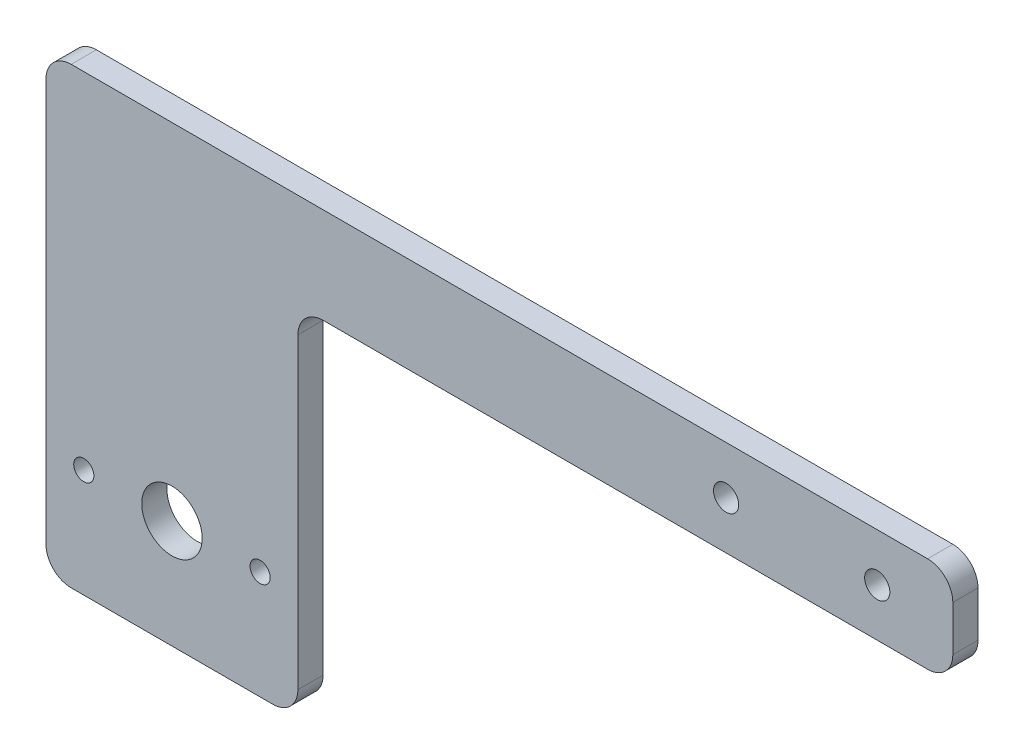
ISO-10303-21;
HEADER;
FILE_DESCRIPTION(('STEP AP214'),'2;1');
FILE_NAME('part.step','',(''),(''),'','','');
FILE_SCHEMA(('AUTOMOTIVE_DESIGN { 1 0 10303 214 1 1 1 1 }'));
ENDSEC;
DATA;
#1=APPLICATION_CONTEXT('core data for automotive mechanical design processes');
#2=APPLICATION_PROTOCOL_DEFINITION('international standard','automotive_design',2000,#1);
#3=PRODUCT_CONTEXT('',#1,'mechanical');
#4=PRODUCT('Part','Part','',(#3));
#5=PRODUCT_RELATED_PRODUCT_CATEGORY('part','',(#4));
#6=PRODUCT_DEFINITION_FORMATION('','',#4);
#7=PRODUCT_DEFINITION_CONTEXT('part definition',#1,'design');
#8=PRODUCT_DEFINITION('design','',#6,#7);
#9=PRODUCT_DEFINITION_SHAPE('','',#8);
#10=(LENGTH_UNIT() NAMED_UNIT(*) SI_UNIT(.MILLI.,.METRE.));
#11=(NAMED_UNIT(*) PLANE_ANGLE_UNIT() SI_UNIT($,.RADIAN.));
#12=(NAMED_UNIT(*) SI_UNIT($,.STERADIAN.) SOLID_ANGLE_UNIT());
#13=UNCERTAINTY_MEASURE_WITH_UNIT(LENGTH_MEASURE(1.E-05),#10,'distance_accuracy_value','');
#14=(GEOMETRIC_REPRESENTATION_CONTEXT(3) GLOBAL_UNCERTAINTY_ASSIGNED_CONTEXT((#13)) GLOBAL_UNIT_ASSIGNED_CONTEXT((#10,
#11,#12)) REPRESENTATION_CONTEXT('',''));
#15=CARTESIAN_POINT('',(0.,0.,0.));
#16=DIRECTION('',(0.,0.,1.));
#17=DIRECTION('',(1.,0.,0.));
#18=AXIS2_PLACEMENT_3D('',#15,#16,#17);
#19=CARTESIAN_POINT('',(0.,0.,5.));
#20=DIRECTION('',(0.,0.,-1.));
#21=DIRECTION('',(-1.,0.,0.));
#22=AXIS2_PLACEMENT_3D('',#19,#20,#21);
#23=PLANE('',#22);
#24=DIRECTION('',(-1.,0.,0.));
#25=VECTOR('',#24,1.);
#26=CARTESIAN_POINT('',(0.,0.,5.));
#27=LINE('',#26,#25);
#28=CARTESIAN_POINT('',(175.,0.,5.));
#29=VERTEX_POINT('',#28);
#30=CARTESIAN_POINT('',(5.,0.,5.));
#31=VERTEX_POINT('',#30);
#32=EDGE_CURVE('E176',#29,#31,#27,.T.);
#33=ORIENTED_EDGE('',*,*,#32,.T.);
#34=CARTESIAN_POINT('',(5.,-5.,5.));
#35=DIRECTION('',(0.,0.,-1.));
#36=DIRECTION('',(-1.,0.,0.));
#37=AXIS2_PLACEMENT_3D('',#34,#35,#36);
#38=CIRCLE('',#37,5.);
#39=CARTESIAN_POINT('',(0.,-5.00000000000003,5.));
#40=VERTEX_POINT('',#39);
#41=EDGE_CURVE('E220',#31,#40,#38,.F.);
#42=ORIENTED_EDGE('',*,*,#41,.T.);
#43=DIRECTION('',(0.,-1.,0.));
#44=VECTOR('',#43,1.);
#45=CARTESIAN_POINT('',(0.,-90.,5.));
#46=LINE('',#45,#44);
#47=CARTESIAN_POINT('',(0.,-85.,5.));
#48=VERTEX_POINT('',#47);
#49=EDGE_CURVE('E155',#40,#48,#46,.T.);
#50=ORIENTED_EDGE('',*,*,#49,.T.);
#51=CARTESIAN_POINT('',(5.,-85.,5.));
#52=DIRECTION('',(0.,0.,-1.));
#53=DIRECTION('',(-1.,0.,0.));
#54=AXIS2_PLACEMENT_3D('',#51,#52,#53);
#55=CIRCLE('',#54,5.);
#56=CARTESIAN_POINT('',(5.,-90.,5.));
#57=VERTEX_POINT('',#56);
#58=EDGE_CURVE('E217',#48,#57,#55,.F.);
#59=ORIENTED_EDGE('',*,*,#58,.T.);
#60=DIRECTION('',(1.,0.,0.));
#61=VECTOR('',#60,1.);
#62=CARTESIAN_POINT('',(50.,-90.,5.));
#63=LINE('',#62,#61);
#64=CARTESIAN_POINT('',(45.,-90.,5.));
#65=VERTEX_POINT('',#64);
#66=EDGE_CURVE('E275',#57,#65,#63,.T.);
#67=ORIENTED_EDGE('',*,*,#66,.T.);
#68=CARTESIAN_POINT('',(45.,-85.,5.));
#69=DIRECTION('',(0.,0.,-1.));
#70=DIRECTION('',(-1.,0.,0.));
#71=AXIS2_PLACEMENT_3D('',#68,#69,#70);
#72=CIRCLE('',#71,5.);
#73=CARTESIAN_POINT('',(50.,-85.,5.));
#74=VERTEX_POINT('',#73);
#75=EDGE_CURVE('E214',#65,#74,#72,.F.);
#76=ORIENTED_EDGE('',*,*,#75,.T.);
#77=DIRECTION('',(0.,1.,0.));
#78=VECTOR('',#77,1.);
#79=CARTESIAN_POINT('',(50.,-19.,5.));
#80=LINE('',#79,#78);
#81=CARTESIAN_POINT('',(50.,-24.,5.));
#82=VERTEX_POINT('',#81);
#83=EDGE_CURVE('E266',#74,#82,#80,.T.);
#84=ORIENTED_EDGE('',*,*,#83,.T.);
#85=CARTESIAN_POINT('',(55.,-24.,5.));
#86=DIRECTION('',(0.,0.,-1.));
#87=DIRECTION('',(-1.,0.,0.));
#88=AXIS2_PLACEMENT_3D('',#85,#86,#87);
#89=CIRCLE('',#88,5.);
#90=CARTESIAN_POINT('',(55.,-19.,5.));
#91=VERTEX_POINT('',#90);
#92=EDGE_CURVE('E11',#82,#91,#89,.T.);
#93=ORIENTED_EDGE('',*,*,#92,.T.);
#94=DIRECTION('',(1.,0.,0.));
#95=VECTOR('',#94,1.);
#96=CARTESIAN_POINT('',(180.,-19.,5.));
#97=LINE('',#96,#95);
#98=CARTESIAN_POINT('',(175.,-19.,5.));
#99=VERTEX_POINT('',#98);
#100=EDGE_CURVE('E265',#91,#99,#97,.T.);
#101=ORIENTED_EDGE('',*,*,#100,.T.);
#102=CARTESIAN_POINT('',(175.,-14.,5.));
#103=DIRECTION('',(0.,0.,-1.));
#104=DIRECTION('',(-1.,0.,0.));
#105=AXIS2_PLACEMENT_3D('',#102,#103,#104);
#106=CIRCLE('',#105,5.);
#107=CARTESIAN_POINT('',(180.,-14.,5.));
#108=VERTEX_POINT('',#107);
#109=EDGE_CURVE('E66',#99,#108,#106,.F.);
#110=ORIENTED_EDGE('',*,*,#109,.T.);
#111=DIRECTION('',(0.,1.,0.));
#112=VECTOR('',#111,1.);
#113=CARTESIAN_POINT('',(180.,0.,5.));
#114=LINE('',#113,#112);
#115=CARTESIAN_POINT('',(180.,-5.,5.));
#116=VERTEX_POINT('',#115);
#117=EDGE_CURVE('E271',#108,#116,#114,.T.);
#118=ORIENTED_EDGE('',*,*,#117,.T.);
#119=CARTESIAN_POINT('',(175.,-5.,5.));
#120=DIRECTION('',(0.,0.,-1.));
#121=DIRECTION('',(-1.,0.,0.));
#122=AXIS2_PLACEMENT_3D('',#119,#120,#121);
#123=CIRCLE('',#122,5.);
#124=EDGE_CURVE('E209',#116,#29,#123,.F.);
#125=ORIENTED_EDGE('',*,*,#124,.T.);
#126=EDGE_LOOP('',(#33,#42,#50,#59,#67,#76,#84,#93,#101,#110,#118,#125));
#127=FACE_BOUND('',#126,.T.);
#128=CARTESIAN_POINT('',(135.,-9.5,5.));
#129=DIRECTION('',(0.,0.,1.));
#130=DIRECTION('',(1.,0.,0.));
#131=AXIS2_PLACEMENT_3D('',#128,#129,#130);
#132=CIRCLE('',#131,2.5);
#133=CARTESIAN_POINT('',(137.5,-9.5,5.));
#134=VERTEX_POINT('',#133);
#135=EDGE_CURVE('E165',#134,#134,#132,.T.);
#136=ORIENTED_EDGE('',*,*,#135,.F.);
#137=EDGE_LOOP('',(#136));
#138=FACE_BOUND('',#137,.T.);
#139=CARTESIAN_POINT('',(165.,-9.5,5.));
#140=DIRECTION('',(0.,0.,1.));
#141=DIRECTION('',(1.,0.,0.));
#142=AXIS2_PLACEMENT_3D('',#139,#140,#141);
#143=CIRCLE('',#142,2.5);
#144=CARTESIAN_POINT('',(167.5,-9.5,5.));
#145=VERTEX_POINT('',#144);
#146=EDGE_CURVE('E285',#145,#145,#143,.T.);
#147=ORIENTED_EDGE('',*,*,#146,.F.);
#148=EDGE_LOOP('',(#147));
#149=FACE_BOUND('',#148,.T.);
#150=CARTESIAN_POINT('',(7.5,-68.5,5.));
#151=DIRECTION('',(0.,0.,1.));
#152=DIRECTION('',(1.,0.,0.));
#153=AXIS2_PLACEMENT_3D('',#150,#151,#152);
#154=CIRCLE('',#153,2.);
#155=CARTESIAN_POINT('',(9.5,-68.5,5.));
#156=VERTEX_POINT('',#155);
#157=EDGE_CURVE('E291',#156,#156,#154,.T.);
#158=ORIENTED_EDGE('',*,*,#157,.F.);
#159=EDGE_LOOP('',(#158));
#160=FACE_BOUND('',#159,.T.);
#161=CARTESIAN_POINT('',(25.,-68.5,5.));
#162=DIRECTION('',(0.,0.,1.));
#163=DIRECTION('',(1.,0.,0.));
#164=AXIS2_PLACEMENT_3D('',#161,#162,#163);
#165=CIRCLE('',#164,6.);
#166=CARTESIAN_POINT('',(31.,-68.5,5.));
#167=VERTEX_POINT('',#166);
#168=EDGE_CURVE('E299',#167,#167,#165,.T.);
#169=ORIENTED_EDGE('',*,*,#168,.F.);
#170=EDGE_LOOP('',(#169));
#171=FACE_BOUND('',#170,.T.);
#172=CARTESIAN_POINT('',(42.5,-68.5,5.));
#173=DIRECTION('',(0.,0.,1.));
#174=DIRECTION('',(1.,0.,0.));
#175=AXIS2_PLACEMENT_3D('',#172,#173,#174);
#176=CIRCLE('',#175,2.);
#177=CARTESIAN_POINT('',(44.5,-68.5,5.));
#178=VERTEX_POINT('',#177);
#179=EDGE_CURVE('E307',#178,#178,#176,.T.);
#180=ORIENTED_EDGE('',*,*,#179,.F.);
#181=EDGE_LOOP('',(#180));
#182=FACE_BOUND('',#181,.T.);
#183=ADVANCED_FACE('F43',(#127,#138,#149,#160,#171,#182),#23,.F.);
#184=CARTESIAN_POINT('',(0.,0.,0.));
#185=DIRECTION('',(0.,0.,-1.));
#186=DIRECTION('',(-1.,0.,0.));
#187=AXIS2_PLACEMENT_3D('',#184,#185,#186);
#188=PLANE('',#187);
#189=CARTESIAN_POINT('',(25.,-68.5,0.));
#190=DIRECTION('',(0.,0.,1.));
#191=DIRECTION('',(1.,0.,0.));
#192=AXIS2_PLACEMENT_3D('',#189,#190,#191);
#193=CIRCLE('',#192,6.);
#194=CARTESIAN_POINT('',(31.,-68.5,0.));
#195=VERTEX_POINT('',#194);
#196=EDGE_CURVE('E303',#195,#195,#193,.T.);
#197=ORIENTED_EDGE('',*,*,#196,.T.);
#198=EDGE_LOOP('',(#197));
#199=FACE_BOUND('',#198,.T.);
#200=CARTESIAN_POINT('',(165.,-9.5,0.));
#201=DIRECTION('',(0.,0.,1.));
#202=DIRECTION('',(1.,0.,0.));
#203=AXIS2_PLACEMENT_3D('',#200,#201,#202);
#204=CIRCLE('',#203,2.5);
#205=CARTESIAN_POINT('',(167.5,-9.5,0.));
#206=VERTEX_POINT('',#205);
#207=EDGE_CURVE('E287',#206,#206,#204,.T.);
#208=ORIENTED_EDGE('',*,*,#207,.T.);
#209=EDGE_LOOP('',(#208));
#210=FACE_BOUND('',#209,.T.);
#211=DIRECTION('',(0.,-1.,0.));
#212=VECTOR('',#211,1.);
#213=CARTESIAN_POINT('',(0.,-90.,0.));
#214=LINE('',#213,#212);
#215=CARTESIAN_POINT('',(0.,-5.00000000000003,0.));
#216=VERTEX_POINT('',#215);
#217=CARTESIAN_POINT('',(0.,-85.,0.));
#218=VERTEX_POINT('',#217);
#219=EDGE_CURVE('E152',#216,#218,#214,.T.);
#220=ORIENTED_EDGE('',*,*,#219,.F.);
#221=CARTESIAN_POINT('',(5.,-5.,0.));
#222=DIRECTION('',(0.,0.,-1.));
#223=DIRECTION('',(-1.,0.,0.));
#224=AXIS2_PLACEMENT_3D('',#221,#222,#223);
#225=CIRCLE('',#224,5.);
#226=CARTESIAN_POINT('',(5.,0.,0.));
#227=VERTEX_POINT('',#226);
#228=EDGE_CURVE('E134',#216,#227,#225,.T.);
#229=ORIENTED_EDGE('',*,*,#228,.T.);
#230=DIRECTION('',(-1.,0.,0.));
#231=VECTOR('',#230,1.);
#232=CARTESIAN_POINT('',(0.,0.,0.));
#233=LINE('',#232,#231);
#234=CARTESIAN_POINT('',(175.,0.,0.));
#235=VERTEX_POINT('',#234);
#236=EDGE_CURVE('E189',#235,#227,#233,.T.);
#237=ORIENTED_EDGE('',*,*,#236,.F.);
#238=CARTESIAN_POINT('',(175.,-5.,0.));
#239=DIRECTION('',(0.,0.,-1.));
#240=DIRECTION('',(-1.,0.,0.));
#241=AXIS2_PLACEMENT_3D('',#238,#239,#240);
#242=CIRCLE('',#241,5.);
#243=CARTESIAN_POINT('',(180.,-5.,0.));
#244=VERTEX_POINT('',#243);
#245=EDGE_CURVE('E157',#235,#244,#242,.T.);
#246=ORIENTED_EDGE('',*,*,#245,.T.);
#247=DIRECTION('',(0.,1.,0.));
#248=VECTOR('',#247,1.);
#249=CARTESIAN_POINT('',(180.,0.,0.));
#250=LINE('',#249,#248);
#251=CARTESIAN_POINT('',(180.,-14.,0.));
#252=VERTEX_POINT('',#251);
#253=EDGE_CURVE('E186',#252,#244,#250,.T.);
#254=ORIENTED_EDGE('',*,*,#253,.F.);
#255=CARTESIAN_POINT('',(175.,-14.,0.));
#256=DIRECTION('',(0.,0.,-1.));
#257=DIRECTION('',(-1.,0.,0.));
#258=AXIS2_PLACEMENT_3D('',#255,#256,#257);
#259=CIRCLE('',#258,5.);
#260=CARTESIAN_POINT('',(175.,-19.,0.));
#261=VERTEX_POINT('',#260);
#262=EDGE_CURVE('E196',#252,#261,#259,.T.);
#263=ORIENTED_EDGE('',*,*,#262,.T.);
#264=DIRECTION('',(1.,0.,0.));
#265=VECTOR('',#264,1.);
#266=CARTESIAN_POINT('',(180.,-19.,0.));
#267=LINE('',#266,#265);
#268=CARTESIAN_POINT('',(55.,-19.,0.));
#269=VERTEX_POINT('',#268);
#270=EDGE_CURVE('E182',#269,#261,#267,.T.);
#271=ORIENTED_EDGE('',*,*,#270,.F.);
#272=CARTESIAN_POINT('',(55.,-24.,0.));
#273=DIRECTION('',(0.,0.,-1.));
#274=DIRECTION('',(-1.,0.,0.));
#275=AXIS2_PLACEMENT_3D('',#272,#273,#274);
#276=CIRCLE('',#275,5.);
#277=CARTESIAN_POINT('',(50.,-24.,0.));
#278=VERTEX_POINT('',#277);
#279=EDGE_CURVE('E52',#269,#278,#276,.F.);
#280=ORIENTED_EDGE('',*,*,#279,.T.);
#281=DIRECTION('',(0.,1.,0.));
#282=VECTOR('',#281,1.);
#283=CARTESIAN_POINT('',(50.,-19.,0.));
#284=LINE('',#283,#282);
#285=CARTESIAN_POINT('',(50.,-85.,0.));
#286=VERTEX_POINT('',#285);
#287=EDGE_CURVE('E170',#286,#278,#284,.T.);
#288=ORIENTED_EDGE('',*,*,#287,.F.);
#289=CARTESIAN_POINT('',(45.,-85.,0.));
#290=DIRECTION('',(0.,0.,-1.));
#291=DIRECTION('',(-1.,0.,0.));
#292=AXIS2_PLACEMENT_3D('',#289,#290,#291);
#293=CIRCLE('',#292,5.);
#294=CARTESIAN_POINT('',(45.,-90.,0.));
#295=VERTEX_POINT('',#294);
#296=EDGE_CURVE('E199',#286,#295,#293,.T.);
#297=ORIENTED_EDGE('',*,*,#296,.T.);
#298=DIRECTION('',(1.,0.,0.));
#299=VECTOR('',#298,1.);
#300=CARTESIAN_POINT('',(50.,-90.,0.));
#301=LINE('',#300,#299);
#302=CARTESIAN_POINT('',(5.,-90.,0.));
#303=VERTEX_POINT('',#302);
#304=EDGE_CURVE('E164',#303,#295,#301,.T.);
#305=ORIENTED_EDGE('',*,*,#304,.F.);
#306=CARTESIAN_POINT('',(5.,-85.,0.));
#307=DIRECTION('',(0.,0.,-1.));
#308=DIRECTION('',(-1.,0.,0.));
#309=AXIS2_PLACEMENT_3D('',#306,#307,#308);
#310=CIRCLE('',#309,5.);
#311=EDGE_CURVE('E146',#303,#218,#310,.T.);
#312=ORIENTED_EDGE('',*,*,#311,.T.);
#313=EDGE_LOOP('',(#220,#229,#237,#246,#254,#263,#271,#280,#288,#297,#305,#312));
#314=FACE_BOUND('',#313,.T.);
#315=CARTESIAN_POINT('',(135.,-9.5,0.));
#316=DIRECTION('',(0.,0.,1.));
#317=DIRECTION('',(1.,0.,0.));
#318=AXIS2_PLACEMENT_3D('',#315,#316,#317);
#319=CIRCLE('',#318,2.5);
#320=CARTESIAN_POINT('',(137.5,-9.5,0.));
#321=VERTEX_POINT('',#320);
#322=EDGE_CURVE('E173',#321,#321,#319,.T.);
#323=ORIENTED_EDGE('',*,*,#322,.T.);
#324=EDGE_LOOP('',(#323));
#325=FACE_BOUND('',#324,.T.);
#326=CARTESIAN_POINT('',(7.5,-68.5,0.));
#327=DIRECTION('',(0.,0.,1.));
#328=DIRECTION('',(1.,0.,0.));
#329=AXIS2_PLACEMENT_3D('',#326,#327,#328);
#330=CIRCLE('',#329,2.);
#331=CARTESIAN_POINT('',(9.5,-68.5,0.));
#332=VERTEX_POINT('',#331);
#333=EDGE_CURVE('E295',#332,#332,#330,.T.);
#334=ORIENTED_EDGE('',*,*,#333,.T.);
#335=EDGE_LOOP('',(#334));
#336=FACE_BOUND('',#335,.T.);
#337=CARTESIAN_POINT('',(42.5,-68.5,0.));
#338=DIRECTION('',(0.,0.,1.));
#339=DIRECTION('',(1.,0.,0.));
#340=AXIS2_PLACEMENT_3D('',#337,#338,#339);
#341=CIRCLE('',#340,2.);
#342=CARTESIAN_POINT('',(44.5,-68.5,0.));
#343=VERTEX_POINT('',#342);
#344=EDGE_CURVE('E311',#343,#343,#341,.T.);
#345=ORIENTED_EDGE('',*,*,#344,.T.);
#346=EDGE_LOOP('',(#345));
#347=FACE_BOUND('',#346,.T.);
#348=ADVANCED_FACE('F160',(#199,#210,#314,#325,#336,#347),#188,.T.);
#349=CARTESIAN_POINT('',(0.,-90.,5.));
#350=DIRECTION('',(1.,0.,0.));
#351=DIRECTION('',(0.,0.,-1.));
#352=AXIS2_PLACEMENT_3D('',#349,#350,#351);
#353=PLANE('',#352);
#354=ORIENTED_EDGE('',*,*,#49,.F.);
#355=DIRECTION('',(0.,0.,-1.));
#356=VECTOR('',#355,1.);
#357=CARTESIAN_POINT('',(0.,-5.,5.));
#358=LINE('',#357,#356);
#359=EDGE_CURVE('E138',#40,#216,#358,.T.);
#360=ORIENTED_EDGE('',*,*,#359,.T.);
#361=ORIENTED_EDGE('',*,*,#219,.T.);
#362=DIRECTION('',(0.,0.,-1.));
#363=VECTOR('',#362,1.);
#364=CARTESIAN_POINT('',(0.,-85.,5.));
#365=LINE('',#364,#363);
#366=EDGE_CURVE('E158',#218,#48,#365,.F.);
#367=ORIENTED_EDGE('',*,*,#366,.T.);
#368=EDGE_LOOP('',(#354,#360,#361,#367));
#369=FACE_BOUND('',#368,.T.);
#370=ADVANCED_FACE('F151',(#369),#353,.F.);
#371=CARTESIAN_POINT('',(50.,-90.,5.));
#372=DIRECTION('',(0.,1.,0.));
#373=DIRECTION('',(0.,0.,1.));
#374=AXIS2_PLACEMENT_3D('',#371,#372,#373);
#375=PLANE('',#374);
#376=ORIENTED_EDGE('',*,*,#66,.F.);
#377=DIRECTION('',(0.,0.,-1.));
#378=VECTOR('',#377,1.);
#379=CARTESIAN_POINT('',(5.,-90.,5.));
#380=LINE('',#379,#378);
#381=EDGE_CURVE('E226',#57,#303,#380,.T.);
#382=ORIENTED_EDGE('',*,*,#381,.T.);
#383=ORIENTED_EDGE('',*,*,#304,.T.);
#384=DIRECTION('',(0.,0.,-1.));
#385=VECTOR('',#384,1.);
#386=CARTESIAN_POINT('',(45.,-90.,5.));
#387=LINE('',#386,#385);
#388=EDGE_CURVE('E223',#295,#65,#387,.F.);
#389=ORIENTED_EDGE('',*,*,#388,.T.);
#390=EDGE_LOOP('',(#376,#382,#383,#389));
#391=FACE_BOUND('',#390,.T.);
#392=ADVANCED_FACE('F344',(#391),#375,.F.);
#393=CARTESIAN_POINT('',(50.,-19.,5.));
#394=DIRECTION('',(-1.,0.,0.));
#395=DIRECTION('',(0.,-1.,0.));
#396=AXIS2_PLACEMENT_3D('',#393,#394,#395);
#397=PLANE('',#396);
#398=ORIENTED_EDGE('',*,*,#83,.F.);
#399=DIRECTION('',(0.,0.,-1.));
#400=VECTOR('',#399,1.);
#401=CARTESIAN_POINT('',(50.,-85.,5.));
#402=LINE('',#401,#400);
#403=EDGE_CURVE('E233',#74,#286,#402,.T.);
#404=ORIENTED_EDGE('',*,*,#403,.T.);
#405=ORIENTED_EDGE('',*,*,#287,.T.);
#406=DIRECTION('',(0.,0.,-1.));
#407=VECTOR('',#406,1.);
#408=CARTESIAN_POINT('',(50.,-24.,5.));
#409=LINE('',#408,#407);
#410=EDGE_CURVE('E230',#278,#82,#409,.F.);
#411=ORIENTED_EDGE('',*,*,#410,.T.);
#412=EDGE_LOOP('',(#398,#404,#405,#411));
#413=FACE_BOUND('',#412,.T.);
#414=ADVANCED_FACE('F257',(#413),#397,.F.);
#415=CARTESIAN_POINT('',(180.,-19.,5.));
#416=DIRECTION('',(0.,1.,0.));
#417=DIRECTION('',(-1.,0.,0.));
#418=AXIS2_PLACEMENT_3D('',#415,#416,#417);
#419=PLANE('',#418);
#420=ORIENTED_EDGE('',*,*,#100,.F.);
#421=DIRECTION('',(0.,0.,-1.));
#422=VECTOR('',#421,1.);
#423=CARTESIAN_POINT('',(55.,-19.,0.));
#424=LINE('',#423,#422);
#425=EDGE_CURVE('E240',#91,#269,#424,.T.);
#426=ORIENTED_EDGE('',*,*,#425,.T.);
#427=ORIENTED_EDGE('',*,*,#270,.T.);
#428=DIRECTION('',(0.,0.,-1.));
#429=VECTOR('',#428,1.);
#430=CARTESIAN_POINT('',(175.,-19.,5.));
#431=LINE('',#430,#429);
#432=EDGE_CURVE('E237',#261,#99,#431,.F.);
#433=ORIENTED_EDGE('',*,*,#432,.T.);
#434=EDGE_LOOP('',(#420,#426,#427,#433));
#435=FACE_BOUND('',#434,.T.);
#436=ADVANCED_FACE('F268',(#435),#419,.F.);
#437=CARTESIAN_POINT('',(180.,0.,5.));
#438=DIRECTION('',(-1.,0.,0.));
#439=DIRECTION('',(0.,0.,1.));
#440=AXIS2_PLACEMENT_3D('',#437,#438,#439);
#441=PLANE('',#440);
#442=ORIENTED_EDGE('',*,*,#117,.F.);
#443=DIRECTION('',(0.,0.,-1.));
#444=VECTOR('',#443,1.);
#445=CARTESIAN_POINT('',(180.,-14.,5.));
#446=LINE('',#445,#444);
#447=EDGE_CURVE('E246',#108,#252,#446,.T.);
#448=ORIENTED_EDGE('',*,*,#447,.T.);
#449=ORIENTED_EDGE('',*,*,#253,.T.);
#450=DIRECTION('',(0.,0.,-1.));
#451=VECTOR('',#450,1.);
#452=CARTESIAN_POINT('',(180.,-5.,5.));
#453=LINE('',#452,#451);
#454=EDGE_CURVE('E59',#244,#116,#453,.F.);
#455=ORIENTED_EDGE('',*,*,#454,.T.);
#456=EDGE_LOOP('',(#442,#448,#449,#455));
#457=FACE_BOUND('',#456,.T.);
#458=ADVANCED_FACE('F336',(#457),#441,.F.);
#459=CARTESIAN_POINT('',(0.,0.,5.));
#460=DIRECTION('',(0.,-1.,0.));
#461=DIRECTION('',(0.,0.,-1.));
#462=AXIS2_PLACEMENT_3D('',#459,#460,#461);
#463=PLANE('',#462);
#464=ORIENTED_EDGE('',*,*,#236,.T.);
#465=DIRECTION('',(0.,0.,-1.));
#466=VECTOR('',#465,1.);
#467=CARTESIAN_POINT('',(5.,0.,5.));
#468=LINE('',#467,#466);
#469=EDGE_CURVE('E139',#227,#31,#468,.F.);
#470=ORIENTED_EDGE('',*,*,#469,.T.);
#471=ORIENTED_EDGE('',*,*,#32,.F.);
#472=DIRECTION('',(0.,0.,-1.));
#473=VECTOR('',#472,1.);
#474=CARTESIAN_POINT('',(175.,0.,5.));
#475=LINE('',#474,#473);
#476=EDGE_CURVE('E145',#29,#235,#475,.T.);
#477=ORIENTED_EDGE('',*,*,#476,.T.);
#478=EDGE_LOOP('',(#464,#470,#471,#477));
#479=FACE_BOUND('',#478,.T.);
#480=ADVANCED_FACE('F333',(#479),#463,.F.);
#481=CARTESIAN_POINT('',(135.,-9.5,5.));
#482=DIRECTION('',(0.,0.,-1.));
#483=DIRECTION('',(-1.,0.,0.));
#484=AXIS2_PLACEMENT_3D('',#481,#482,#483);
#485=CYLINDRICAL_SURFACE('',#484,2.5);
#486=ORIENTED_EDGE('',*,*,#135,.T.);
#487=EDGE_LOOP('',(#486));
#488=FACE_BOUND('',#487,.T.);
#489=ORIENTED_EDGE('',*,*,#322,.F.);
#490=EDGE_LOOP('',(#489));
#491=FACE_BOUND('',#490,.T.);
#492=ADVANCED_FACE('F330',(#488,#491),#485,.F.);
#493=CARTESIAN_POINT('',(165.,-9.5,5.));
#494=DIRECTION('',(0.,0.,-1.));
#495=DIRECTION('',(-1.,0.,0.));
#496=AXIS2_PLACEMENT_3D('',#493,#494,#495);
#497=CYLINDRICAL_SURFACE('',#496,2.5);
#498=ORIENTED_EDGE('',*,*,#146,.T.);
#499=EDGE_LOOP('',(#498));
#500=FACE_BOUND('',#499,.T.);
#501=ORIENTED_EDGE('',*,*,#207,.F.);
#502=EDGE_LOOP('',(#501));
#503=FACE_BOUND('',#502,.T.);
#504=ADVANCED_FACE('F501',(#500,#503),#497,.F.);
#505=CARTESIAN_POINT('',(7.5,-68.5,5.));
#506=DIRECTION('',(0.,0.,-1.));
#507=DIRECTION('',(-1.,0.,0.));
#508=AXIS2_PLACEMENT_3D('',#505,#506,#507);
#509=CYLINDRICAL_SURFACE('',#508,2.);
#510=ORIENTED_EDGE('',*,*,#157,.T.);
#511=EDGE_LOOP('',(#510));
#512=FACE_BOUND('',#511,.T.);
#513=ORIENTED_EDGE('',*,*,#333,.F.);
#514=EDGE_LOOP('',(#513));
#515=FACE_BOUND('',#514,.T.);
#516=ADVANCED_FACE('F490',(#512,#515),#509,.F.);
#517=CARTESIAN_POINT('',(25.,-68.5,5.));
#518=DIRECTION('',(0.,0.,-1.));
#519=DIRECTION('',(-1.,0.,0.));
#520=AXIS2_PLACEMENT_3D('',#517,#518,#519);
#521=CYLINDRICAL_SURFACE('',#520,6.);
#522=ORIENTED_EDGE('',*,*,#168,.T.);
#523=EDGE_LOOP('',(#522));
#524=FACE_BOUND('',#523,.T.);
#525=ORIENTED_EDGE('',*,*,#196,.F.);
#526=EDGE_LOOP('',(#525));
#527=FACE_BOUND('',#526,.T.);
#528=ADVANCED_FACE('F480',(#524,#527),#521,.F.);
#529=CARTESIAN_POINT('',(42.5,-68.5,5.));
#530=DIRECTION('',(0.,0.,-1.));
#531=DIRECTION('',(-1.,0.,0.));
#532=AXIS2_PLACEMENT_3D('',#529,#530,#531);
#533=CYLINDRICAL_SURFACE('',#532,2.);
#534=ORIENTED_EDGE('',*,*,#179,.T.);
#535=EDGE_LOOP('',(#534));
#536=FACE_BOUND('',#535,.T.);
#537=ORIENTED_EDGE('',*,*,#344,.F.);
#538=EDGE_LOOP('',(#537));
#539=FACE_BOUND('',#538,.T.);
#540=ADVANCED_FACE('F319',(#536,#539),#533,.F.);
#541=CARTESIAN_POINT('',(5.,-5.,5.));
#542=DIRECTION('',(0.,0.,-1.));
#543=DIRECTION('',(-1.,0.,0.));
#544=AXIS2_PLACEMENT_3D('',#541,#542,#543);
#545=CYLINDRICAL_SURFACE('',#544,5.);
#546=ORIENTED_EDGE('',*,*,#41,.F.);
#547=ORIENTED_EDGE('',*,*,#469,.F.);
#548=ORIENTED_EDGE('',*,*,#228,.F.);
#549=ORIENTED_EDGE('',*,*,#359,.F.);
#550=EDGE_LOOP('',(#546,#547,#548,#549));
#551=FACE_BOUND('',#550,.T.);
#552=ADVANCED_FACE('F137',(#551),#545,.T.);
#553=CARTESIAN_POINT('',(5.,-85.,5.));
#554=DIRECTION('',(0.,0.,-1.));
#555=DIRECTION('',(-1.,0.,0.));
#556=AXIS2_PLACEMENT_3D('',#553,#554,#555);
#557=CYLINDRICAL_SURFACE('',#556,5.);
#558=ORIENTED_EDGE('',*,*,#58,.F.);
#559=ORIENTED_EDGE('',*,*,#366,.F.);
#560=ORIENTED_EDGE('',*,*,#311,.F.);
#561=ORIENTED_EDGE('',*,*,#381,.F.);
#562=EDGE_LOOP('',(#558,#559,#560,#561));
#563=FACE_BOUND('',#562,.T.);
#564=ADVANCED_FACE('F352',(#563),#557,.T.);
#565=CARTESIAN_POINT('',(45.,-85.,5.));
#566=DIRECTION('',(0.,0.,-1.));
#567=DIRECTION('',(-1.,0.,0.));
#568=AXIS2_PLACEMENT_3D('',#565,#566,#567);
#569=CYLINDRICAL_SURFACE('',#568,5.);
#570=ORIENTED_EDGE('',*,*,#75,.F.);
#571=ORIENTED_EDGE('',*,*,#388,.F.);
#572=ORIENTED_EDGE('',*,*,#296,.F.);
#573=ORIENTED_EDGE('',*,*,#403,.F.);
#574=EDGE_LOOP('',(#570,#571,#572,#573));
#575=FACE_BOUND('',#574,.T.);
#576=ADVANCED_FACE('F355',(#575),#569,.T.);
#577=CARTESIAN_POINT('',(55.,-24.,5.));
#578=DIRECTION('',(0.,0.,1.));
#579=DIRECTION('',(1.,0.,0.));
#580=AXIS2_PLACEMENT_3D('',#577,#578,#579);
#581=CYLINDRICAL_SURFACE('',#580,5.);
#582=ORIENTED_EDGE('',*,*,#92,.F.);
#583=ORIENTED_EDGE('',*,*,#410,.F.);
#584=ORIENTED_EDGE('',*,*,#279,.F.);
#585=ORIENTED_EDGE('',*,*,#425,.F.);
#586=EDGE_LOOP('',(#582,#583,#584,#585));
#587=FACE_BOUND('',#586,.T.);
#588=ADVANCED_FACE('F261',(#587),#581,.F.);
#589=CARTESIAN_POINT('',(175.,-14.,5.));
#590=DIRECTION('',(0.,0.,-1.));
#591=DIRECTION('',(-1.,0.,0.));
#592=AXIS2_PLACEMENT_3D('',#589,#590,#591);
#593=CYLINDRICAL_SURFACE('',#592,5.);
#594=ORIENTED_EDGE('',*,*,#109,.F.);
#595=ORIENTED_EDGE('',*,*,#432,.F.);
#596=ORIENTED_EDGE('',*,*,#262,.F.);
#597=ORIENTED_EDGE('',*,*,#447,.F.);
#598=EDGE_LOOP('',(#594,#595,#596,#597));
#599=FACE_BOUND('',#598,.T.);
#600=ADVANCED_FACE('F361',(#599),#593,.T.);
#601=CARTESIAN_POINT('',(175.,-5.,5.));
#602=DIRECTION('',(0.,0.,-1.));
#603=DIRECTION('',(-1.,0.,0.));
#604=AXIS2_PLACEMENT_3D('',#601,#602,#603);
#605=CYLINDRICAL_SURFACE('',#604,5.);
#606=ORIENTED_EDGE('',*,*,#124,.F.);
#607=ORIENTED_EDGE('',*,*,#454,.F.);
#608=ORIENTED_EDGE('',*,*,#245,.F.);
#609=ORIENTED_EDGE('',*,*,#476,.F.);
#610=EDGE_LOOP('',(#606,#607,#608,#609));
#611=FACE_BOUND('',#610,.T.);
#612=ADVANCED_FACE('F45',(#611),#605,.T.);
#613=CLOSED_SHELL('',(#183,#348,#370,#392,#414,#436,#458,#480,#492,#504,#516,#528,#540,#552,
#564,#576,#588,#600,#612));
#614=MANIFOLD_SOLID_BREP('B2',#613);
#615=ADVANCED_BREP_SHAPE_REPRESENTATION('',(#18,#614),#14);
#616=SHAPE_DEFINITION_REPRESENTATION(#9,#615);
ENDSEC;
END-ISO-10303-21;
